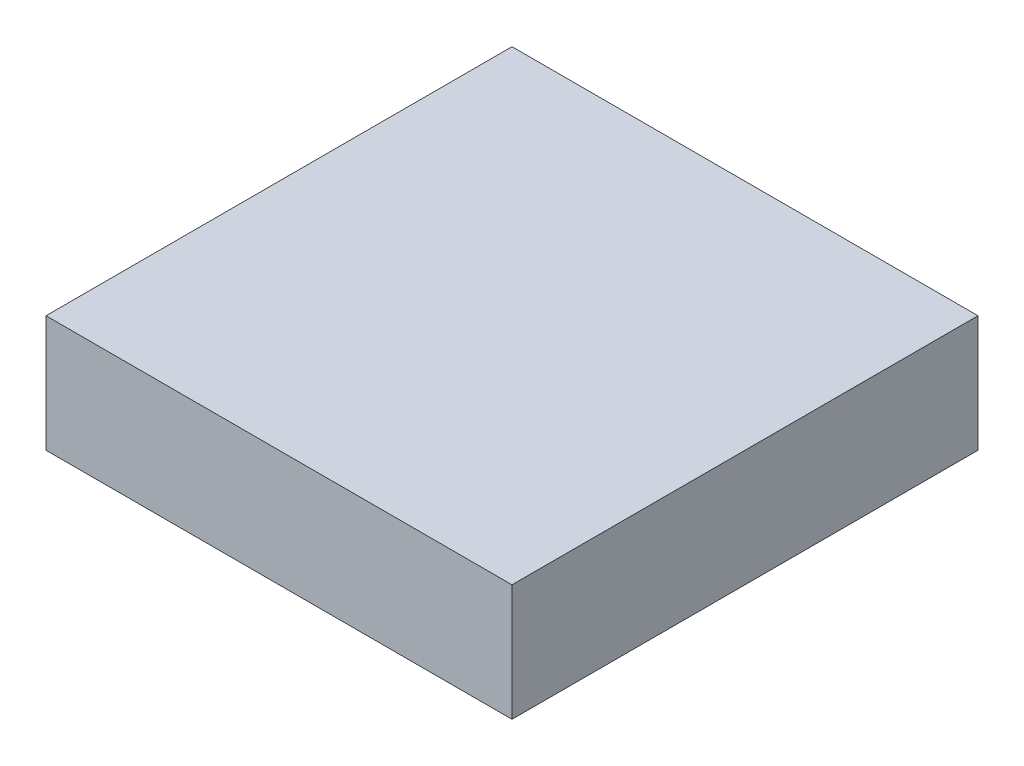
ISO-10303-21;
HEADER;
FILE_DESCRIPTION(('STEP AP214'),'2;1');
FILE_NAME('part.step','',(''),(''),'','','');
FILE_SCHEMA(('AUTOMOTIVE_DESIGN { 1 0 10303 214 1 1 1 1 }'));
ENDSEC;
DATA;
#1=APPLICATION_CONTEXT('core data for automotive mechanical design processes');
#2=APPLICATION_PROTOCOL_DEFINITION('international standard','automotive_design',2000,#1);
#3=PRODUCT_CONTEXT('',#1,'mechanical');
#4=PRODUCT('Part','Part','',(#3));
#5=PRODUCT_RELATED_PRODUCT_CATEGORY('part','',(#4));
#6=PRODUCT_DEFINITION_FORMATION('','',#4);
#7=PRODUCT_DEFINITION_CONTEXT('part definition',#1,'design');
#8=PRODUCT_DEFINITION('design','',#6,#7);
#9=PRODUCT_DEFINITION_SHAPE('','',#8);
#10=(LENGTH_UNIT() NAMED_UNIT(*) SI_UNIT(.MILLI.,.METRE.));
#11=(NAMED_UNIT(*) PLANE_ANGLE_UNIT() SI_UNIT($,.RADIAN.));
#12=(NAMED_UNIT(*) SI_UNIT($,.STERADIAN.) SOLID_ANGLE_UNIT());
#13=UNCERTAINTY_MEASURE_WITH_UNIT(LENGTH_MEASURE(1.E-05),#10,'distance_accuracy_value','');
#14=(GEOMETRIC_REPRESENTATION_CONTEXT(3) GLOBAL_UNCERTAINTY_ASSIGNED_CONTEXT((#13)) GLOBAL_UNIT_ASSIGNED_CONTEXT((#10,
#11,#12)) REPRESENTATION_CONTEXT('',''));
#15=CARTESIAN_POINT('',(0.,0.,0.));
#16=DIRECTION('',(0.,0.,1.));
#17=DIRECTION('',(1.,0.,0.));
#18=AXIS2_PLACEMENT_3D('',#15,#16,#17);
#19=CARTESIAN_POINT('',(0.,76.2,0.));
#20=DIRECTION('',(0.,-1.,0.));
#21=DIRECTION('',(0.,0.,-1.));
#22=AXIS2_PLACEMENT_3D('',#19,#20,#21);
#23=PLANE('',#22);
#24=DIRECTION('',(-1.,0.,0.));
#25=VECTOR('',#24,1.);
#26=CARTESIAN_POINT('',(505.459999999999,76.2,1013.46));
#27=LINE('',#26,#25);
#28=CARTESIAN_POINT('',(505.459999999999,76.2,1013.46));
#29=VERTEX_POINT('',#28);
#30=CARTESIAN_POINT('',(429.259999999999,76.2,1013.46));
#31=VERTEX_POINT('',#30);
#32=EDGE_CURVE('E102',#29,#31,#27,.T.);
#33=ORIENTED_EDGE('',*,*,#32,.F.);
#34=DIRECTION('',(0.,0.,1.));
#35=VECTOR('',#34,1.);
#36=CARTESIAN_POINT('',(505.459999999999,76.2,1013.46));
#37=LINE('',#36,#35);
#38=CARTESIAN_POINT('',(505.459999999999,76.2,937.26));
#39=VERTEX_POINT('',#38);
#40=EDGE_CURVE('E77',#39,#29,#37,.T.);
#41=ORIENTED_EDGE('',*,*,#40,.F.);
#42=DIRECTION('',(1.,0.,0.));
#43=VECTOR('',#42,1.);
#44=CARTESIAN_POINT('',(505.459999999999,76.2,937.26));
#45=LINE('',#44,#43);
#46=CARTESIAN_POINT('',(429.26,76.2,937.26));
#47=VERTEX_POINT('',#46);
#48=EDGE_CURVE('E71',#47,#39,#45,.T.);
#49=ORIENTED_EDGE('',*,*,#48,.F.);
#50=DIRECTION('',(0.,0.,-1.));
#51=VECTOR('',#50,1.);
#52=CARTESIAN_POINT('',(429.26,76.2,937.26));
#53=LINE('',#52,#51);
#54=EDGE_CURVE('E94',#31,#47,#53,.T.);
#55=ORIENTED_EDGE('',*,*,#54,.F.);
#56=EDGE_LOOP('',(#33,#41,#49,#55));
#57=FACE_BOUND('',#56,.T.);
#58=ADVANCED_FACE('F38',(#57),#23,.F.);
#59=CARTESIAN_POINT('',(505.459999999999,57.15,1013.46));
#60=DIRECTION('',(-1.,0.,0.));
#61=DIRECTION('',(0.,0.,1.));
#62=AXIS2_PLACEMENT_3D('',#59,#60,#61);
#63=PLANE('',#62);
#64=ORIENTED_EDGE('',*,*,#40,.T.);
#65=DIRECTION('',(0.,1.,0.));
#66=VECTOR('',#65,1.);
#67=CARTESIAN_POINT('',(505.459999999999,57.15,1013.46));
#68=LINE('',#67,#66);
#69=CARTESIAN_POINT('',(505.459999999999,57.15,1013.46));
#70=VERTEX_POINT('',#69);
#71=EDGE_CURVE('E98',#70,#29,#68,.T.);
#72=ORIENTED_EDGE('',*,*,#71,.F.);
#73=DIRECTION('',(0.,0.,1.));
#74=VECTOR('',#73,1.);
#75=CARTESIAN_POINT('',(505.459999999999,57.15,1013.46));
#76=LINE('',#75,#74);
#77=CARTESIAN_POINT('',(505.459999999999,57.15,937.26));
#78=VERTEX_POINT('',#77);
#79=EDGE_CURVE('E55',#78,#70,#76,.T.);
#80=ORIENTED_EDGE('',*,*,#79,.F.);
#81=DIRECTION('',(0.,1.,0.));
#82=VECTOR('',#81,1.);
#83=CARTESIAN_POINT('',(505.459999999999,57.15,937.26));
#84=LINE('',#83,#82);
#85=EDGE_CURVE('E95',#78,#39,#84,.T.);
#86=ORIENTED_EDGE('',*,*,#85,.T.);
#87=EDGE_LOOP('',(#64,#72,#80,#86));
#88=FACE_BOUND('',#87,.T.);
#89=ADVANCED_FACE('F109',(#88),#63,.F.);
#90=CARTESIAN_POINT('',(505.459999999999,57.15,1013.46));
#91=DIRECTION('',(0.,0.,-1.));
#92=DIRECTION('',(-1.,0.,0.));
#93=AXIS2_PLACEMENT_3D('',#90,#91,#92);
#94=PLANE('',#93);
#95=ORIENTED_EDGE('',*,*,#32,.T.);
#96=DIRECTION('',(0.,1.,0.));
#97=VECTOR('',#96,1.);
#98=CARTESIAN_POINT('',(429.259999999999,57.15,1013.46));
#99=LINE('',#98,#97);
#100=CARTESIAN_POINT('',(429.259999999999,57.15,1013.46));
#101=VERTEX_POINT('',#100);
#102=EDGE_CURVE('E11',#101,#31,#99,.T.);
#103=ORIENTED_EDGE('',*,*,#102,.F.);
#104=DIRECTION('',(-1.,0.,0.));
#105=VECTOR('',#104,1.);
#106=CARTESIAN_POINT('',(505.459999999999,57.15,1013.46));
#107=LINE('',#106,#105);
#108=EDGE_CURVE('E89',#70,#101,#107,.T.);
#109=ORIENTED_EDGE('',*,*,#108,.F.);
#110=ORIENTED_EDGE('',*,*,#71,.T.);
#111=EDGE_LOOP('',(#95,#103,#109,#110));
#112=FACE_BOUND('',#111,.T.);
#113=ADVANCED_FACE('F40',(#112),#94,.F.);
#114=CARTESIAN_POINT('',(0.,57.15,0.));
#115=DIRECTION('',(0.,-1.,0.));
#116=DIRECTION('',(0.,0.,-1.));
#117=AXIS2_PLACEMENT_3D('',#114,#115,#116);
#118=PLANE('',#117);
#119=ORIENTED_EDGE('',*,*,#108,.T.);
#120=DIRECTION('',(0.,0.,-1.));
#121=VECTOR('',#120,1.);
#122=CARTESIAN_POINT('',(429.259999999999,57.15,1013.46));
#123=LINE('',#122,#121);
#124=CARTESIAN_POINT('',(429.26,57.15,937.26));
#125=VERTEX_POINT('',#124);
#126=EDGE_CURVE('E84',#101,#125,#123,.T.);
#127=ORIENTED_EDGE('',*,*,#126,.T.);
#128=DIRECTION('',(1.,0.,0.));
#129=VECTOR('',#128,1.);
#130=CARTESIAN_POINT('',(429.26,57.15,937.26));
#131=LINE('',#130,#129);
#132=EDGE_CURVE('E87',#125,#78,#131,.T.);
#133=ORIENTED_EDGE('',*,*,#132,.T.);
#134=ORIENTED_EDGE('',*,*,#79,.T.);
#135=EDGE_LOOP('',(#119,#127,#133,#134));
#136=FACE_BOUND('',#135,.T.);
#137=ADVANCED_FACE('F85',(#136),#118,.T.);
#138=CARTESIAN_POINT('',(505.459999999999,57.15,937.26));
#139=DIRECTION('',(0.,0.,1.));
#140=DIRECTION('',(1.,0.,0.));
#141=AXIS2_PLACEMENT_3D('',#138,#139,#140);
#142=PLANE('',#141);
#143=ORIENTED_EDGE('',*,*,#48,.T.);
#144=ORIENTED_EDGE('',*,*,#85,.F.);
#145=ORIENTED_EDGE('',*,*,#132,.F.);
#146=DIRECTION('',(0.,1.,0.));
#147=VECTOR('',#146,1.);
#148=CARTESIAN_POINT('',(429.26,57.15,937.26));
#149=LINE('',#148,#147);
#150=EDGE_CURVE('E47',#125,#47,#149,.T.);
#151=ORIENTED_EDGE('',*,*,#150,.T.);
#152=EDGE_LOOP('',(#143,#144,#145,#151));
#153=FACE_BOUND('',#152,.T.);
#154=ADVANCED_FACE('F96',(#153),#142,.F.);
#155=CARTESIAN_POINT('',(429.26,57.15,937.26));
#156=DIRECTION('',(1.,0.,0.));
#157=DIRECTION('',(0.,0.,-1.));
#158=AXIS2_PLACEMENT_3D('',#155,#156,#157);
#159=PLANE('',#158);
#160=ORIENTED_EDGE('',*,*,#54,.T.);
#161=ORIENTED_EDGE('',*,*,#150,.F.);
#162=ORIENTED_EDGE('',*,*,#126,.F.);
#163=ORIENTED_EDGE('',*,*,#102,.T.);
#164=EDGE_LOOP('',(#160,#161,#162,#163));
#165=FACE_BOUND('',#164,.T.);
#166=ADVANCED_FACE('F93',(#165),#159,.F.);
#167=CLOSED_SHELL('',(#58,#89,#113,#137,#154,#166));
#168=MANIFOLD_SOLID_BREP('B2',#167);
#169=ADVANCED_BREP_SHAPE_REPRESENTATION('',(#18,#168),#14);
#170=SHAPE_DEFINITION_REPRESENTATION(#9,#169);
ENDSEC;
END-ISO-10303-21;
